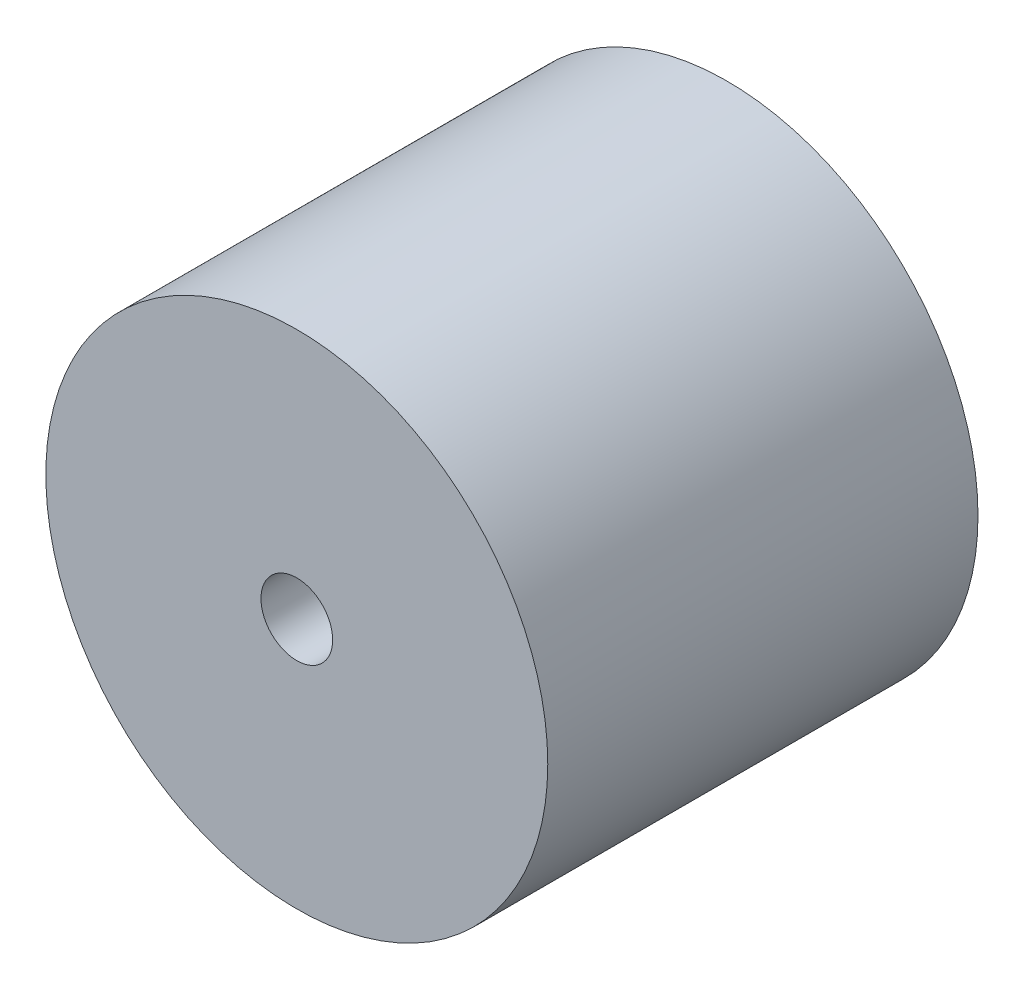
ISO-10303-21;
HEADER;
FILE_DESCRIPTION(('STEP AP214'),'2;1');
FILE_NAME('part.step','',(''),(''),'','','');
FILE_SCHEMA(('AUTOMOTIVE_DESIGN { 1 0 10303 214 1 1 1 1 }'));
ENDSEC;
DATA;
#1=APPLICATION_CONTEXT('core data for automotive mechanical design processes');
#2=APPLICATION_PROTOCOL_DEFINITION('international standard','automotive_design',2000,#1);
#3=PRODUCT_CONTEXT('',#1,'mechanical');
#4=PRODUCT('Part','Part','',(#3));
#5=PRODUCT_RELATED_PRODUCT_CATEGORY('part','',(#4));
#6=PRODUCT_DEFINITION_FORMATION('','',#4);
#7=PRODUCT_DEFINITION_CONTEXT('part definition',#1,'design');
#8=PRODUCT_DEFINITION('design','',#6,#7);
#9=PRODUCT_DEFINITION_SHAPE('','',#8);
#10=(LENGTH_UNIT() NAMED_UNIT(*) SI_UNIT(.MILLI.,.METRE.));
#11=(NAMED_UNIT(*) PLANE_ANGLE_UNIT() SI_UNIT($,.RADIAN.));
#12=(NAMED_UNIT(*) SI_UNIT($,.STERADIAN.) SOLID_ANGLE_UNIT());
#13=UNCERTAINTY_MEASURE_WITH_UNIT(LENGTH_MEASURE(1.E-05),#10,'distance_accuracy_value','');
#14=(GEOMETRIC_REPRESENTATION_CONTEXT(3) GLOBAL_UNCERTAINTY_ASSIGNED_CONTEXT((#13)) GLOBAL_UNIT_ASSIGNED_CONTEXT((#10,
#11,#12)) REPRESENTATION_CONTEXT('',''));
#15=CARTESIAN_POINT('',(0.,0.,0.));
#16=DIRECTION('',(0.,0.,1.));
#17=DIRECTION('',(1.,0.,0.));
#18=AXIS2_PLACEMENT_3D('',#15,#16,#17);
#19=CARTESIAN_POINT('',(0.,0.,60.));
#20=DIRECTION('',(0.,0.,-1.));
#21=DIRECTION('',(-1.,0.,0.));
#22=AXIS2_PLACEMENT_3D('',#19,#20,#21);
#23=CYLINDRICAL_SURFACE('',#22,35.);
#24=CARTESIAN_POINT('',(0.,0.,60.));
#25=DIRECTION('',(0.,0.,1.));
#26=DIRECTION('',(1.,0.,0.));
#27=AXIS2_PLACEMENT_3D('',#24,#25,#26);
#28=CIRCLE('',#27,35.);
#29=CARTESIAN_POINT('',(35.,0.,60.));
#30=VERTEX_POINT('',#29);
#31=EDGE_CURVE('E10',#30,#30,#28,.T.);
#32=ORIENTED_EDGE('',*,*,#31,.F.);
#33=EDGE_LOOP('',(#32));
#34=FACE_BOUND('',#33,.T.);
#35=CARTESIAN_POINT('',(0.,0.,0.));
#36=DIRECTION('',(0.,0.,1.));
#37=DIRECTION('',(1.,0.,0.));
#38=AXIS2_PLACEMENT_3D('',#35,#36,#37);
#39=CIRCLE('',#38,35.);
#40=CARTESIAN_POINT('',(35.,0.,0.));
#41=VERTEX_POINT('',#40);
#42=EDGE_CURVE('E34',#41,#41,#39,.T.);
#43=ORIENTED_EDGE('',*,*,#42,.T.);
#44=EDGE_LOOP('',(#43));
#45=FACE_BOUND('',#44,.T.);
#46=ADVANCED_FACE('F31',(#34,#45),#23,.T.);
#47=CARTESIAN_POINT('',(0.,0.,60.));
#48=DIRECTION('',(0.,0.,1.));
#49=DIRECTION('',(1.,0.,0.));
#50=AXIS2_PLACEMENT_3D('',#47,#48,#49);
#51=PLANE('',#50);
#52=CARTESIAN_POINT('',(0.,0.,60.));
#53=DIRECTION('',(0.,0.,1.));
#54=DIRECTION('',(1.,0.,0.));
#55=AXIS2_PLACEMENT_3D('',#52,#53,#54);
#56=CIRCLE('',#55,5.);
#57=CARTESIAN_POINT('',(5.,0.,60.));
#58=VERTEX_POINT('',#57);
#59=EDGE_CURVE('E43',#58,#58,#56,.T.);
#60=ORIENTED_EDGE('',*,*,#59,.F.);
#61=EDGE_LOOP('',(#60));
#62=FACE_BOUND('',#61,.T.);
#63=ORIENTED_EDGE('',*,*,#31,.T.);
#64=EDGE_LOOP('',(#63));
#65=FACE_BOUND('',#64,.T.);
#66=ADVANCED_FACE('F58',(#62,#65),#51,.T.);
#67=CARTESIAN_POINT('',(0.,0.,0.));
#68=DIRECTION('',(0.,0.,1.));
#69=DIRECTION('',(1.,0.,0.));
#70=AXIS2_PLACEMENT_3D('',#67,#68,#69);
#71=PLANE('',#70);
#72=CARTESIAN_POINT('',(0.,0.,0.));
#73=DIRECTION('',(0.,0.,1.));
#74=DIRECTION('',(1.,0.,0.));
#75=AXIS2_PLACEMENT_3D('',#72,#73,#74);
#76=CIRCLE('',#75,5.);
#77=CARTESIAN_POINT('',(5.,0.,0.));
#78=VERTEX_POINT('',#77);
#79=EDGE_CURVE('E41',#78,#78,#76,.T.);
#80=ORIENTED_EDGE('',*,*,#79,.T.);
#81=EDGE_LOOP('',(#80));
#82=FACE_BOUND('',#81,.T.);
#83=ORIENTED_EDGE('',*,*,#42,.F.);
#84=EDGE_LOOP('',(#83));
#85=FACE_BOUND('',#84,.T.);
#86=ADVANCED_FACE('F49',(#82,#85),#71,.F.);
#87=CARTESIAN_POINT('',(0.,0.,0.));
#88=DIRECTION('',(0.,0.,1.));
#89=DIRECTION('',(1.,0.,0.));
#90=AXIS2_PLACEMENT_3D('',#87,#88,#89);
#91=CYLINDRICAL_SURFACE('',#90,5.);
#92=ORIENTED_EDGE('',*,*,#79,.F.);
#93=EDGE_LOOP('',(#92));
#94=FACE_BOUND('',#93,.T.);
#95=ORIENTED_EDGE('',*,*,#59,.T.);
#96=EDGE_LOOP('',(#95));
#97=FACE_BOUND('',#96,.T.);
#98=ADVANCED_FACE('F52',(#94,#97),#91,.F.);
#99=CLOSED_SHELL('',(#46,#66,#86,#98));
#100=MANIFOLD_SOLID_BREP('B2',#99);
#101=ADVANCED_BREP_SHAPE_REPRESENTATION('',(#18,#100),#14);
#102=SHAPE_DEFINITION_REPRESENTATION(#9,#101);
ENDSEC;
END-ISO-10303-21;
